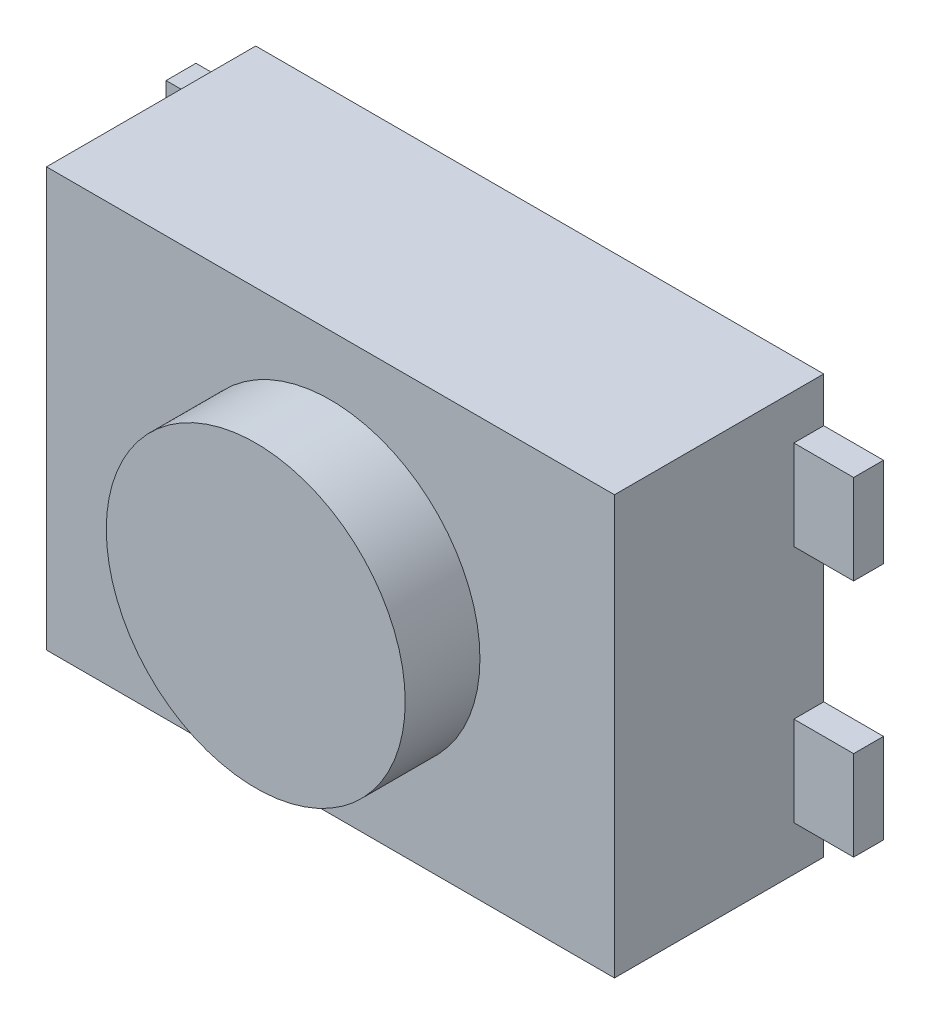
ISO-10303-21;
HEADER;
FILE_DESCRIPTION(('STEP AP214'),'2;1');
FILE_NAME('part.step','',(''),(''),'','','');
FILE_SCHEMA(('AUTOMOTIVE_DESIGN { 1 0 10303 214 1 1 1 1 }'));
ENDSEC;
DATA;
#1=APPLICATION_CONTEXT('core data for automotive mechanical design processes');
#2=APPLICATION_PROTOCOL_DEFINITION('international standard','automotive_design',2000,#1);
#3=PRODUCT_CONTEXT('',#1,'mechanical');
#4=PRODUCT('Part','Part','',(#3));
#5=PRODUCT_RELATED_PRODUCT_CATEGORY('part','',(#4));
#6=PRODUCT_DEFINITION_FORMATION('','',#4);
#7=PRODUCT_DEFINITION_CONTEXT('part definition',#1,'design');
#8=PRODUCT_DEFINITION('design','',#6,#7);
#9=PRODUCT_DEFINITION_SHAPE('','',#8);
#10=(LENGTH_UNIT() NAMED_UNIT(*) SI_UNIT(.MILLI.,.METRE.));
#11=(NAMED_UNIT(*) PLANE_ANGLE_UNIT() SI_UNIT($,.RADIAN.));
#12=(NAMED_UNIT(*) SI_UNIT($,.STERADIAN.) SOLID_ANGLE_UNIT());
#13=UNCERTAINTY_MEASURE_WITH_UNIT(LENGTH_MEASURE(1.E-05),#10,'distance_accuracy_value','');
#14=(GEOMETRIC_REPRESENTATION_CONTEXT(3) GLOBAL_UNCERTAINTY_ASSIGNED_CONTEXT((#13)) GLOBAL_UNIT_ASSIGNED_CONTEXT((#10,
#11,#12)) REPRESENTATION_CONTEXT('',''));
#15=CARTESIAN_POINT('',(0.,0.,0.));
#16=DIRECTION('',(0.,0.,1.));
#17=DIRECTION('',(1.,0.,0.));
#18=AXIS2_PLACEMENT_3D('',#15,#16,#17);
#19=CARTESIAN_POINT('',(2.1,0.8,0.));
#20=DIRECTION('',(0.,0.,1.));
#21=DIRECTION('',(1.,0.,0.));
#22=AXIS2_PLACEMENT_3D('',#19,#20,#21);
#23=PLANE('',#22);
#24=DIRECTION('',(-1.,0.,0.));
#25=VECTOR('',#24,1.);
#26=CARTESIAN_POINT('',(2.3,1.1,0.));
#27=LINE('',#26,#25);
#28=CARTESIAN_POINT('',(2.3,1.1,0.));
#29=VERTEX_POINT('',#28);
#30=CARTESIAN_POINT('',(1.9,1.1,0.));
#31=VERTEX_POINT('',#30);
#32=EDGE_CURVE('P0_E79',#29,#31,#27,.T.);
#33=ORIENTED_EDGE('',*,*,#32,.F.);
#34=DIRECTION('',(0.,1.,0.));
#35=VECTOR('',#34,1.);
#36=CARTESIAN_POINT('',(2.3,0.5,0.));
#37=LINE('',#36,#35);
#38=CARTESIAN_POINT('',(2.3,0.5,0.));
#39=VERTEX_POINT('',#38);
#40=EDGE_CURVE('P0_E55',#39,#29,#37,.T.);
#41=ORIENTED_EDGE('',*,*,#40,.F.);
#42=DIRECTION('',(1.,0.,0.));
#43=VECTOR('',#42,1.);
#44=CARTESIAN_POINT('',(1.9,0.5,0.));
#45=LINE('',#44,#43);
#46=CARTESIAN_POINT('',(1.9,0.5,0.));
#47=VERTEX_POINT('',#46);
#48=EDGE_CURVE('P0_E57',#47,#39,#45,.T.);
#49=ORIENTED_EDGE('',*,*,#48,.F.);
#50=DIRECTION('',(0.,1.,0.));
#51=VECTOR('',#50,1.);
#52=CARTESIAN_POINT('',(1.9,1.1,0.));
#53=LINE('',#52,#51);
#54=EDGE_CURVE('P0_E20',#31,#47,#53,.F.);
#55=ORIENTED_EDGE('',*,*,#54,.F.);
#56=EDGE_LOOP('',(#33,#41,#49,#55));
#57=FACE_BOUND('',#56,.T.);
#58=ADVANCED_FACE('P0_F17',(#57),#23,.F.);
#59=CARTESIAN_POINT('',(1.9,1.1,0.));
#60=DIRECTION('',(-1.,0.,0.));
#61=DIRECTION('',(0.,0.,1.));
#62=AXIS2_PLACEMENT_3D('',#59,#60,#61);
#63=PLANE('',#62);
#64=DIRECTION('',(0.,1.,0.));
#65=VECTOR('',#64,1.);
#66=CARTESIAN_POINT('',(1.9,0.8,0.2));
#67=LINE('',#66,#65);
#68=CARTESIAN_POINT('',(1.9,1.1,0.2));
#69=VERTEX_POINT('',#68);
#70=CARTESIAN_POINT('',(1.9,0.5,0.2));
#71=VERTEX_POINT('',#70);
#72=EDGE_CURVE('P0_E83',#69,#71,#67,.F.);
#73=ORIENTED_EDGE('',*,*,#72,.F.);
#74=DIRECTION('',(0.,0.,1.));
#75=VECTOR('',#74,1.);
#76=CARTESIAN_POINT('',(1.9,1.1,0.));
#77=LINE('',#76,#75);
#78=EDGE_CURVE('P0_E68',#31,#69,#77,.T.);
#79=ORIENTED_EDGE('',*,*,#78,.F.);
#80=ORIENTED_EDGE('',*,*,#54,.T.);
#81=DIRECTION('',(0.,0.,-1.));
#82=VECTOR('',#81,1.);
#83=CARTESIAN_POINT('',(1.9,0.5,0.));
#84=LINE('',#83,#82);
#85=EDGE_CURVE('P0_E63',#71,#47,#84,.T.);
#86=ORIENTED_EDGE('',*,*,#85,.F.);
#87=EDGE_LOOP('',(#73,#79,#80,#86));
#88=FACE_BOUND('',#87,.T.);
#89=ADVANCED_FACE('P0_F65',(#88),#63,.T.);
#90=CARTESIAN_POINT('',(1.9,0.5,0.));
#91=DIRECTION('',(0.,-1.,0.));
#92=DIRECTION('',(0.,0.,-1.));
#93=AXIS2_PLACEMENT_3D('',#90,#91,#92);
#94=PLANE('',#93);
#95=DIRECTION('',(1.,0.,0.));
#96=VECTOR('',#95,1.);
#97=CARTESIAN_POINT('',(2.1,0.5,0.2));
#98=LINE('',#97,#96);
#99=CARTESIAN_POINT('',(2.3,0.5,0.2));
#100=VERTEX_POINT('',#99);
#101=EDGE_CURVE('P0_E72',#71,#100,#98,.T.);
#102=ORIENTED_EDGE('',*,*,#101,.F.);
#103=ORIENTED_EDGE('',*,*,#85,.T.);
#104=ORIENTED_EDGE('',*,*,#48,.T.);
#105=DIRECTION('',(0.,0.,-1.));
#106=VECTOR('',#105,1.);
#107=CARTESIAN_POINT('',(2.3,0.5,0.));
#108=LINE('',#107,#106);
#109=EDGE_CURVE('P0_E75',#100,#39,#108,.T.);
#110=ORIENTED_EDGE('',*,*,#109,.F.);
#111=EDGE_LOOP('',(#102,#103,#104,#110));
#112=FACE_BOUND('',#111,.T.);
#113=ADVANCED_FACE('P0_F70',(#112),#94,.T.);
#114=CARTESIAN_POINT('',(2.3,0.5,0.));
#115=DIRECTION('',(1.,0.,0.));
#116=DIRECTION('',(0.,0.,-1.));
#117=AXIS2_PLACEMENT_3D('',#114,#115,#116);
#118=PLANE('',#117);
#119=DIRECTION('',(0.,1.,0.));
#120=VECTOR('',#119,1.);
#121=CARTESIAN_POINT('',(2.3,0.8,0.2));
#122=LINE('',#121,#120);
#123=CARTESIAN_POINT('',(2.3,1.1,0.2));
#124=VERTEX_POINT('',#123);
#125=EDGE_CURVE('P0_E26',#100,#124,#122,.T.);
#126=ORIENTED_EDGE('',*,*,#125,.F.);
#127=ORIENTED_EDGE('',*,*,#109,.T.);
#128=ORIENTED_EDGE('',*,*,#40,.T.);
#129=DIRECTION('',(0.,0.,1.));
#130=VECTOR('',#129,1.);
#131=CARTESIAN_POINT('',(2.3,1.1,0.));
#132=LINE('',#131,#130);
#133=EDGE_CURVE('P0_E35',#124,#29,#132,.F.);
#134=ORIENTED_EDGE('',*,*,#133,.F.);
#135=EDGE_LOOP('',(#126,#127,#128,#134));
#136=FACE_BOUND('',#135,.T.);
#137=ADVANCED_FACE('P0_F89',(#136),#118,.T.);
#138=CARTESIAN_POINT('',(2.3,1.1,0.));
#139=DIRECTION('',(0.,1.,0.));
#140=DIRECTION('',(-1.,0.,0.));
#141=AXIS2_PLACEMENT_3D('',#138,#139,#140);
#142=PLANE('',#141);
#143=DIRECTION('',(1.,0.,0.));
#144=VECTOR('',#143,1.);
#145=CARTESIAN_POINT('',(2.1,1.1,0.2));
#146=LINE('',#145,#144);
#147=EDGE_CURVE('P0_E11',#124,#69,#146,.F.);
#148=ORIENTED_EDGE('',*,*,#147,.F.);
#149=ORIENTED_EDGE('',*,*,#133,.T.);
#150=ORIENTED_EDGE('',*,*,#32,.T.);
#151=ORIENTED_EDGE('',*,*,#78,.T.);
#152=EDGE_LOOP('',(#148,#149,#150,#151));
#153=FACE_BOUND('',#152,.T.);
#154=ADVANCED_FACE('P0_F91',(#153),#142,.T.);
#155=CARTESIAN_POINT('',(2.1,0.8,0.2));
#156=DIRECTION('',(0.,0.,1.));
#157=DIRECTION('',(1.,0.,0.));
#158=AXIS2_PLACEMENT_3D('',#155,#156,#157);
#159=PLANE('',#158);
#160=ORIENTED_EDGE('',*,*,#125,.T.);
#161=ORIENTED_EDGE('',*,*,#147,.T.);
#162=ORIENTED_EDGE('',*,*,#72,.T.);
#163=ORIENTED_EDGE('',*,*,#101,.T.);
#164=EDGE_LOOP('',(#160,#161,#162,#163));
#165=FACE_BOUND('',#164,.T.);
#166=ADVANCED_FACE('P0_F88',(#165),#159,.T.);
#167=CLOSED_SHELL('',(#58,#89,#113,#137,#154,#166));
#168=MANIFOLD_SOLID_BREP('P0_B1',#167);
#169=CARTESIAN_POINT('',(-2.1,-0.8,0.));
#170=DIRECTION('',(0.,0.,1.));
#171=DIRECTION('',(1.,0.,0.));
#172=AXIS2_PLACEMENT_3D('',#169,#170,#171);
#173=PLANE('',#172);
#174=DIRECTION('',(1.,0.,0.));
#175=VECTOR('',#174,1.);
#176=CARTESIAN_POINT('',(-2.3,-1.1,0.));
#177=LINE('',#176,#175);
#178=CARTESIAN_POINT('',(-2.3,-1.1,0.));
#179=VERTEX_POINT('',#178);
#180=CARTESIAN_POINT('',(-1.9,-1.1,0.));
#181=VERTEX_POINT('',#180);
#182=EDGE_CURVE('P1_E79',#179,#181,#177,.T.);
#183=ORIENTED_EDGE('',*,*,#182,.F.);
#184=DIRECTION('',(0.,-1.,0.));
#185=VECTOR('',#184,1.);
#186=CARTESIAN_POINT('',(-2.3,-0.500000000000001,0.));
#187=LINE('',#186,#185);
#188=CARTESIAN_POINT('',(-2.3,-0.500000000000001,0.));
#189=VERTEX_POINT('',#188);
#190=EDGE_CURVE('P1_E55',#189,#179,#187,.T.);
#191=ORIENTED_EDGE('',*,*,#190,.F.);
#192=DIRECTION('',(-1.,0.,0.));
#193=VECTOR('',#192,1.);
#194=CARTESIAN_POINT('',(-1.9,-0.500000000000001,0.));
#195=LINE('',#194,#193);
#196=CARTESIAN_POINT('',(-1.9,-0.500000000000001,0.));
#197=VERTEX_POINT('',#196);
#198=EDGE_CURVE('P1_E57',#197,#189,#195,.T.);
#199=ORIENTED_EDGE('',*,*,#198,.F.);
#200=DIRECTION('',(0.,1.,0.));
#201=VECTOR('',#200,1.);
#202=CARTESIAN_POINT('',(-1.9,-1.1,0.));
#203=LINE('',#202,#201);
#204=EDGE_CURVE('P1_E20',#181,#197,#203,.T.);
#205=ORIENTED_EDGE('',*,*,#204,.F.);
#206=EDGE_LOOP('',(#183,#191,#199,#205));
#207=FACE_BOUND('',#206,.T.);
#208=ADVANCED_FACE('P1_F17',(#207),#173,.F.);
#209=CARTESIAN_POINT('',(-1.9,-1.1,0.));
#210=DIRECTION('',(1.,0.,0.));
#211=DIRECTION('',(0.,0.,-1.));
#212=AXIS2_PLACEMENT_3D('',#209,#210,#211);
#213=PLANE('',#212);
#214=DIRECTION('',(0.,1.,0.));
#215=VECTOR('',#214,1.);
#216=CARTESIAN_POINT('',(-1.9,-0.8,0.2));
#217=LINE('',#216,#215);
#218=CARTESIAN_POINT('',(-1.9,-1.1,0.2));
#219=VERTEX_POINT('',#218);
#220=CARTESIAN_POINT('',(-1.9,-0.500000000000001,0.2));
#221=VERTEX_POINT('',#220);
#222=EDGE_CURVE('P1_E83',#219,#221,#217,.T.);
#223=ORIENTED_EDGE('',*,*,#222,.F.);
#224=DIRECTION('',(0.,0.,-1.));
#225=VECTOR('',#224,1.);
#226=CARTESIAN_POINT('',(-1.9,-1.1,0.));
#227=LINE('',#226,#225);
#228=EDGE_CURVE('P1_E68',#181,#219,#227,.F.);
#229=ORIENTED_EDGE('',*,*,#228,.F.);
#230=ORIENTED_EDGE('',*,*,#204,.T.);
#231=DIRECTION('',(0.,0.,1.));
#232=VECTOR('',#231,1.);
#233=CARTESIAN_POINT('',(-1.9,-0.500000000000001,0.));
#234=LINE('',#233,#232);
#235=EDGE_CURVE('P1_E63',#221,#197,#234,.F.);
#236=ORIENTED_EDGE('',*,*,#235,.F.);
#237=EDGE_LOOP('',(#223,#229,#230,#236));
#238=FACE_BOUND('',#237,.T.);
#239=ADVANCED_FACE('P1_F65',(#238),#213,.T.);
#240=CARTESIAN_POINT('',(-1.9,-0.500000000000001,0.));
#241=DIRECTION('',(0.,1.,0.));
#242=DIRECTION('',(-1.,0.,0.));
#243=AXIS2_PLACEMENT_3D('',#240,#241,#242);
#244=PLANE('',#243);
#245=DIRECTION('',(1.,0.,0.));
#246=VECTOR('',#245,1.);
#247=CARTESIAN_POINT('',(-2.1,-0.500000000000001,0.2));
#248=LINE('',#247,#246);
#249=CARTESIAN_POINT('',(-2.3,-0.500000000000001,0.2));
#250=VERTEX_POINT('',#249);
#251=EDGE_CURVE('P1_E72',#221,#250,#248,.F.);
#252=ORIENTED_EDGE('',*,*,#251,.F.);
#253=ORIENTED_EDGE('',*,*,#235,.T.);
#254=ORIENTED_EDGE('',*,*,#198,.T.);
#255=DIRECTION('',(0.,0.,1.));
#256=VECTOR('',#255,1.);
#257=CARTESIAN_POINT('',(-2.3,-0.500000000000001,0.));
#258=LINE('',#257,#256);
#259=EDGE_CURVE('P1_E75',#250,#189,#258,.F.);
#260=ORIENTED_EDGE('',*,*,#259,.F.);
#261=EDGE_LOOP('',(#252,#253,#254,#260));
#262=FACE_BOUND('',#261,.T.);
#263=ADVANCED_FACE('P1_F70',(#262),#244,.T.);
#264=CARTESIAN_POINT('',(-2.3,-0.500000000000001,0.));
#265=DIRECTION('',(-1.,0.,0.));
#266=DIRECTION('',(0.,-1.,0.));
#267=AXIS2_PLACEMENT_3D('',#264,#265,#266);
#268=PLANE('',#267);
#269=DIRECTION('',(0.,1.,0.));
#270=VECTOR('',#269,1.);
#271=CARTESIAN_POINT('',(-2.3,-0.8,0.2));
#272=LINE('',#271,#270);
#273=CARTESIAN_POINT('',(-2.3,-1.1,0.2));
#274=VERTEX_POINT('',#273);
#275=EDGE_CURVE('P1_E26',#250,#274,#272,.F.);
#276=ORIENTED_EDGE('',*,*,#275,.F.);
#277=ORIENTED_EDGE('',*,*,#259,.T.);
#278=ORIENTED_EDGE('',*,*,#190,.T.);
#279=DIRECTION('',(0.,0.,-1.));
#280=VECTOR('',#279,1.);
#281=CARTESIAN_POINT('',(-2.3,-1.1,0.));
#282=LINE('',#281,#280);
#283=EDGE_CURVE('P1_E35',#274,#179,#282,.T.);
#284=ORIENTED_EDGE('',*,*,#283,.F.);
#285=EDGE_LOOP('',(#276,#277,#278,#284));
#286=FACE_BOUND('',#285,.T.);
#287=ADVANCED_FACE('P1_F89',(#286),#268,.T.);
#288=CARTESIAN_POINT('',(-2.3,-1.1,0.));
#289=DIRECTION('',(0.,-1.,0.));
#290=DIRECTION('',(0.,0.,-1.));
#291=AXIS2_PLACEMENT_3D('',#288,#289,#290);
#292=PLANE('',#291);
#293=DIRECTION('',(1.,0.,0.));
#294=VECTOR('',#293,1.);
#295=CARTESIAN_POINT('',(-2.1,-1.1,0.2));
#296=LINE('',#295,#294);
#297=EDGE_CURVE('P1_E11',#274,#219,#296,.T.);
#298=ORIENTED_EDGE('',*,*,#297,.F.);
#299=ORIENTED_EDGE('',*,*,#283,.T.);
#300=ORIENTED_EDGE('',*,*,#182,.T.);
#301=ORIENTED_EDGE('',*,*,#228,.T.);
#302=EDGE_LOOP('',(#298,#299,#300,#301));
#303=FACE_BOUND('',#302,.T.);
#304=ADVANCED_FACE('P1_F91',(#303),#292,.T.);
#305=CARTESIAN_POINT('',(-2.1,-0.8,0.2));
#306=DIRECTION('',(0.,0.,1.));
#307=DIRECTION('',(1.,0.,0.));
#308=AXIS2_PLACEMENT_3D('',#305,#306,#307);
#309=PLANE('',#308);
#310=ORIENTED_EDGE('',*,*,#275,.T.);
#311=ORIENTED_EDGE('',*,*,#297,.T.);
#312=ORIENTED_EDGE('',*,*,#222,.T.);
#313=ORIENTED_EDGE('',*,*,#251,.T.);
#314=EDGE_LOOP('',(#310,#311,#312,#313));
#315=FACE_BOUND('',#314,.T.);
#316=ADVANCED_FACE('P1_F88',(#315),#309,.T.);
#317=CLOSED_SHELL('',(#208,#239,#263,#287,#304,#316));
#318=MANIFOLD_SOLID_BREP('P1_B1',#317);
#319=CARTESIAN_POINT('',(0.,0.,1.9));
#320=DIRECTION('',(0.,0.,1.));
#321=DIRECTION('',(1.,0.,0.));
#322=AXIS2_PLACEMENT_3D('',#319,#320,#321);
#323=PLANE('',#322);
#324=CARTESIAN_POINT('',(0.,0.,1.9));
#325=DIRECTION('',(0.,0.,1.));
#326=DIRECTION('',(1.,0.,0.));
#327=AXIS2_PLACEMENT_3D('',#324,#325,#326);
#328=CIRCLE('',#327,1.);
#329=CARTESIAN_POINT('',(1.,0.,1.9));
#330=VERTEX_POINT('',#329);
#331=EDGE_CURVE('P2_E18',#330,#330,#328,.F.);
#332=ORIENTED_EDGE('',*,*,#331,.F.);
#333=EDGE_LOOP('',(#332));
#334=FACE_BOUND('',#333,.T.);
#335=ADVANCED_FACE('P2_F15',(#334),#323,.T.);
#336=CARTESIAN_POINT('',(0.,0.,1.4));
#337=DIRECTION('',(0.,0.,1.));
#338=DIRECTION('',(1.,0.,0.));
#339=AXIS2_PLACEMENT_3D('',#336,#337,#338);
#340=PLANE('',#339);
#341=CARTESIAN_POINT('',(0.,0.,1.4));
#342=DIRECTION('',(0.,0.,1.));
#343=DIRECTION('',(1.,0.,0.));
#344=AXIS2_PLACEMENT_3D('',#341,#342,#343);
#345=CIRCLE('',#344,1.);
#346=CARTESIAN_POINT('',(1.,0.,1.4));
#347=VERTEX_POINT('',#346);
#348=EDGE_CURVE('P2_E10',#347,#347,#345,.T.);
#349=ORIENTED_EDGE('',*,*,#348,.F.);
#350=EDGE_LOOP('',(#349));
#351=FACE_BOUND('',#350,.T.);
#352=ADVANCED_FACE('P2_F30',(#351),#340,.F.);
#353=CARTESIAN_POINT('',(0.,0.,1.4));
#354=DIRECTION('',(0.,0.,1.));
#355=DIRECTION('',(1.,0.,0.));
#356=AXIS2_PLACEMENT_3D('',#353,#354,#355);
#357=CYLINDRICAL_SURFACE('',#356,1.);
#358=ORIENTED_EDGE('',*,*,#348,.T.);
#359=EDGE_LOOP('',(#358));
#360=FACE_BOUND('',#359,.T.);
#361=ORIENTED_EDGE('',*,*,#331,.T.);
#362=EDGE_LOOP('',(#361));
#363=FACE_BOUND('',#362,.T.);
#364=ADVANCED_FACE('P2_F27',(#360,#363),#357,.T.);
#365=CLOSED_SHELL('',(#335,#352,#364));
#366=MANIFOLD_SOLID_BREP('P2_B1',#365);
#367=CARTESIAN_POINT('',(2.1,-0.8,0.));
#368=DIRECTION('',(0.,0.,1.));
#369=DIRECTION('',(1.,0.,0.));
#370=AXIS2_PLACEMENT_3D('',#367,#368,#369);
#371=PLANE('',#370);
#372=DIRECTION('',(0.,1.,0.));
#373=VECTOR('',#372,1.);
#374=CARTESIAN_POINT('',(2.3,-1.1,0.));
#375=LINE('',#374,#373);
#376=CARTESIAN_POINT('',(2.3,-1.1,0.));
#377=VERTEX_POINT('',#376);
#378=CARTESIAN_POINT('',(2.3,-0.5,0.));
#379=VERTEX_POINT('',#378);
#380=EDGE_CURVE('P3_E79',#377,#379,#375,.T.);
#381=ORIENTED_EDGE('',*,*,#380,.F.);
#382=DIRECTION('',(1.,0.,0.));
#383=VECTOR('',#382,1.);
#384=CARTESIAN_POINT('',(1.9,-1.1,0.));
#385=LINE('',#384,#383);
#386=CARTESIAN_POINT('',(1.9,-1.1,0.));
#387=VERTEX_POINT('',#386);
#388=EDGE_CURVE('P3_E55',#387,#377,#385,.T.);
#389=ORIENTED_EDGE('',*,*,#388,.F.);
#390=DIRECTION('',(0.,1.,0.));
#391=VECTOR('',#390,1.);
#392=CARTESIAN_POINT('',(1.9,-0.5,0.));
#393=LINE('',#392,#391);
#394=CARTESIAN_POINT('',(1.9,-0.5,0.));
#395=VERTEX_POINT('',#394);
#396=EDGE_CURVE('P3_E57',#395,#387,#393,.F.);
#397=ORIENTED_EDGE('',*,*,#396,.F.);
#398=DIRECTION('',(1.,0.,0.));
#399=VECTOR('',#398,1.);
#400=CARTESIAN_POINT('',(2.3,-0.5,0.));
#401=LINE('',#400,#399);
#402=EDGE_CURVE('P3_E20',#379,#395,#401,.F.);
#403=ORIENTED_EDGE('',*,*,#402,.F.);
#404=EDGE_LOOP('',(#381,#389,#397,#403));
#405=FACE_BOUND('',#404,.T.);
#406=ADVANCED_FACE('P3_F17',(#405),#371,.F.);
#407=CARTESIAN_POINT('',(2.3,-0.5,0.));
#408=DIRECTION('',(0.,1.,0.));
#409=DIRECTION('',(0.,0.,1.));
#410=AXIS2_PLACEMENT_3D('',#407,#408,#409);
#411=PLANE('',#410);
#412=DIRECTION('',(1.,0.,0.));
#413=VECTOR('',#412,1.);
#414=CARTESIAN_POINT('',(2.1,-0.5,0.2));
#415=LINE('',#414,#413);
#416=CARTESIAN_POINT('',(2.3,-0.5,0.2));
#417=VERTEX_POINT('',#416);
#418=CARTESIAN_POINT('',(1.9,-0.5,0.2));
#419=VERTEX_POINT('',#418);
#420=EDGE_CURVE('P3_E83',#417,#419,#415,.F.);
#421=ORIENTED_EDGE('',*,*,#420,.F.);
#422=DIRECTION('',(0.,0.,1.));
#423=VECTOR('',#422,1.);
#424=CARTESIAN_POINT('',(2.3,-0.5,0.));
#425=LINE('',#424,#423);
#426=EDGE_CURVE('P3_E68',#379,#417,#425,.T.);
#427=ORIENTED_EDGE('',*,*,#426,.F.);
#428=ORIENTED_EDGE('',*,*,#402,.T.);
#429=DIRECTION('',(0.,0.,1.));
#430=VECTOR('',#429,1.);
#431=CARTESIAN_POINT('',(1.9,-0.5,0.));
#432=LINE('',#431,#430);
#433=EDGE_CURVE('P3_E63',#419,#395,#432,.F.);
#434=ORIENTED_EDGE('',*,*,#433,.F.);
#435=EDGE_LOOP('',(#421,#427,#428,#434));
#436=FACE_BOUND('',#435,.T.);
#437=ADVANCED_FACE('P3_F65',(#436),#411,.T.);
#438=CARTESIAN_POINT('',(1.9,-0.5,0.));
#439=DIRECTION('',(-1.,0.,0.));
#440=DIRECTION('',(0.,0.,1.));
#441=AXIS2_PLACEMENT_3D('',#438,#439,#440);
#442=PLANE('',#441);
#443=DIRECTION('',(0.,1.,0.));
#444=VECTOR('',#443,1.);
#445=CARTESIAN_POINT('',(1.9,-0.8,0.2));
#446=LINE('',#445,#444);
#447=CARTESIAN_POINT('',(1.9,-1.1,0.2));
#448=VERTEX_POINT('',#447);
#449=EDGE_CURVE('P3_E72',#419,#448,#446,.F.);
#450=ORIENTED_EDGE('',*,*,#449,.F.);
#451=ORIENTED_EDGE('',*,*,#433,.T.);
#452=ORIENTED_EDGE('',*,*,#396,.T.);
#453=DIRECTION('',(0.,0.,1.));
#454=VECTOR('',#453,1.);
#455=CARTESIAN_POINT('',(1.9,-1.1,0.));
#456=LINE('',#455,#454);
#457=EDGE_CURVE('P3_E75',#448,#387,#456,.F.);
#458=ORIENTED_EDGE('',*,*,#457,.F.);
#459=EDGE_LOOP('',(#450,#451,#452,#458));
#460=FACE_BOUND('',#459,.T.);
#461=ADVANCED_FACE('P3_F70',(#460),#442,.T.);
#462=CARTESIAN_POINT('',(1.9,-1.1,0.));
#463=DIRECTION('',(0.,-1.,0.));
#464=DIRECTION('',(1.,0.,0.));
#465=AXIS2_PLACEMENT_3D('',#462,#463,#464);
#466=PLANE('',#465);
#467=DIRECTION('',(1.,0.,0.));
#468=VECTOR('',#467,1.);
#469=CARTESIAN_POINT('',(2.1,-1.1,0.2));
#470=LINE('',#469,#468);
#471=CARTESIAN_POINT('',(2.3,-1.1,0.2));
#472=VERTEX_POINT('',#471);
#473=EDGE_CURVE('P3_E26',#448,#472,#470,.T.);
#474=ORIENTED_EDGE('',*,*,#473,.F.);
#475=ORIENTED_EDGE('',*,*,#457,.T.);
#476=ORIENTED_EDGE('',*,*,#388,.T.);
#477=DIRECTION('',(0.,0.,1.));
#478=VECTOR('',#477,1.);
#479=CARTESIAN_POINT('',(2.3,-1.1,0.));
#480=LINE('',#479,#478);
#481=EDGE_CURVE('P3_E35',#472,#377,#480,.F.);
#482=ORIENTED_EDGE('',*,*,#481,.F.);
#483=EDGE_LOOP('',(#474,#475,#476,#482));
#484=FACE_BOUND('',#483,.T.);
#485=ADVANCED_FACE('P3_F89',(#484),#466,.T.);
#486=CARTESIAN_POINT('',(2.3,-1.1,0.));
#487=DIRECTION('',(1.,0.,0.));
#488=DIRECTION('',(0.,1.,0.));
#489=AXIS2_PLACEMENT_3D('',#486,#487,#488);
#490=PLANE('',#489);
#491=DIRECTION('',(0.,1.,0.));
#492=VECTOR('',#491,1.);
#493=CARTESIAN_POINT('',(2.3,-0.8,0.2));
#494=LINE('',#493,#492);
#495=EDGE_CURVE('P3_E11',#472,#417,#494,.T.);
#496=ORIENTED_EDGE('',*,*,#495,.F.);
#497=ORIENTED_EDGE('',*,*,#481,.T.);
#498=ORIENTED_EDGE('',*,*,#380,.T.);
#499=ORIENTED_EDGE('',*,*,#426,.T.);
#500=EDGE_LOOP('',(#496,#497,#498,#499));
#501=FACE_BOUND('',#500,.T.);
#502=ADVANCED_FACE('P3_F91',(#501),#490,.T.);
#503=CARTESIAN_POINT('',(2.1,-0.8,0.2));
#504=DIRECTION('',(0.,0.,1.));
#505=DIRECTION('',(1.,0.,0.));
#506=AXIS2_PLACEMENT_3D('',#503,#504,#505);
#507=PLANE('',#506);
#508=ORIENTED_EDGE('',*,*,#473,.T.);
#509=ORIENTED_EDGE('',*,*,#495,.T.);
#510=ORIENTED_EDGE('',*,*,#420,.T.);
#511=ORIENTED_EDGE('',*,*,#449,.T.);
#512=EDGE_LOOP('',(#508,#509,#510,#511));
#513=FACE_BOUND('',#512,.T.);
#514=ADVANCED_FACE('P3_F88',(#513),#507,.T.);
#515=CLOSED_SHELL('',(#406,#437,#461,#485,#502,#514));
#516=MANIFOLD_SOLID_BREP('P3_B1',#515);
#517=CARTESIAN_POINT('',(0.,0.,0.));
#518=DIRECTION('',(0.,0.,1.));
#519=DIRECTION('',(1.,0.,0.));
#520=AXIS2_PLACEMENT_3D('',#517,#518,#519);
#521=PLANE('',#520);
#522=DIRECTION('',(0.,1.,0.));
#523=VECTOR('',#522,1.);
#524=CARTESIAN_POINT('',(-1.9,1.4,0.));
#525=LINE('',#524,#523);
#526=CARTESIAN_POINT('',(-1.9,1.4,0.));
#527=VERTEX_POINT('',#526);
#528=CARTESIAN_POINT('',(-1.9,-1.4,0.));
#529=VERTEX_POINT('',#528);
#530=EDGE_CURVE('P4_E79',#527,#529,#525,.F.);
#531=ORIENTED_EDGE('',*,*,#530,.F.);
#532=DIRECTION('',(1.,0.,0.));
#533=VECTOR('',#532,1.);
#534=CARTESIAN_POINT('',(1.9,1.4,0.));
#535=LINE('',#534,#533);
#536=CARTESIAN_POINT('',(1.9,1.4,0.));
#537=VERTEX_POINT('',#536);
#538=EDGE_CURVE('P4_E55',#537,#527,#535,.F.);
#539=ORIENTED_EDGE('',*,*,#538,.F.);
#540=DIRECTION('',(0.,1.,0.));
#541=VECTOR('',#540,1.);
#542=CARTESIAN_POINT('',(1.9,-1.4,0.));
#543=LINE('',#542,#541);
#544=CARTESIAN_POINT('',(1.9,-1.4,0.));
#545=VERTEX_POINT('',#544);
#546=EDGE_CURVE('P4_E57',#545,#537,#543,.T.);
#547=ORIENTED_EDGE('',*,*,#546,.F.);
#548=DIRECTION('',(1.,0.,0.));
#549=VECTOR('',#548,1.);
#550=CARTESIAN_POINT('',(-1.9,-1.4,0.));
#551=LINE('',#550,#549);
#552=EDGE_CURVE('P4_E20',#529,#545,#551,.T.);
#553=ORIENTED_EDGE('',*,*,#552,.F.);
#554=EDGE_LOOP('',(#531,#539,#547,#553));
#555=FACE_BOUND('',#554,.T.);
#556=ADVANCED_FACE('P4_F17',(#555),#521,.F.);
#557=CARTESIAN_POINT('',(-1.9,-1.4,0.));
#558=DIRECTION('',(0.,-1.,0.));
#559=DIRECTION('',(0.,0.,-1.));
#560=AXIS2_PLACEMENT_3D('',#557,#558,#559);
#561=PLANE('',#560);
#562=DIRECTION('',(1.,0.,0.));
#563=VECTOR('',#562,1.);
#564=CARTESIAN_POINT('',(0.,-1.4,1.4));
#565=LINE('',#564,#563);
#566=CARTESIAN_POINT('',(-1.9,-1.4,1.4));
#567=VERTEX_POINT('',#566);
#568=CARTESIAN_POINT('',(1.9,-1.4,1.4));
#569=VERTEX_POINT('',#568);
#570=EDGE_CURVE('P4_E83',#567,#569,#565,.T.);
#571=ORIENTED_EDGE('',*,*,#570,.F.);
#572=DIRECTION('',(0.,0.,1.));
#573=VECTOR('',#572,1.);
#574=CARTESIAN_POINT('',(-1.9,-1.4,0.));
#575=LINE('',#574,#573);
#576=EDGE_CURVE('P4_E68',#529,#567,#575,.T.);
#577=ORIENTED_EDGE('',*,*,#576,.F.);
#578=ORIENTED_EDGE('',*,*,#552,.T.);
#579=DIRECTION('',(0.,0.,-1.));
#580=VECTOR('',#579,1.);
#581=CARTESIAN_POINT('',(1.9,-1.4,0.));
#582=LINE('',#581,#580);
#583=EDGE_CURVE('P4_E63',#569,#545,#582,.T.);
#584=ORIENTED_EDGE('',*,*,#583,.F.);
#585=EDGE_LOOP('',(#571,#577,#578,#584));
#586=FACE_BOUND('',#585,.T.);
#587=ADVANCED_FACE('P4_F65',(#586),#561,.T.);
#588=CARTESIAN_POINT('',(1.9,-1.4,0.));
#589=DIRECTION('',(1.,0.,0.));
#590=DIRECTION('',(0.,0.,-1.));
#591=AXIS2_PLACEMENT_3D('',#588,#589,#590);
#592=PLANE('',#591);
#593=DIRECTION('',(0.,1.,0.));
#594=VECTOR('',#593,1.);
#595=CARTESIAN_POINT('',(1.9,0.,1.4));
#596=LINE('',#595,#594);
#597=CARTESIAN_POINT('',(1.9,1.4,1.4));
#598=VERTEX_POINT('',#597);
#599=EDGE_CURVE('P4_E72',#569,#598,#596,.T.);
#600=ORIENTED_EDGE('',*,*,#599,.F.);
#601=ORIENTED_EDGE('',*,*,#583,.T.);
#602=ORIENTED_EDGE('',*,*,#546,.T.);
#603=DIRECTION('',(0.,0.,1.));
#604=VECTOR('',#603,1.);
#605=CARTESIAN_POINT('',(1.9,1.4,0.));
#606=LINE('',#605,#604);
#607=EDGE_CURVE('P4_E75',#598,#537,#606,.F.);
#608=ORIENTED_EDGE('',*,*,#607,.F.);
#609=EDGE_LOOP('',(#600,#601,#602,#608));
#610=FACE_BOUND('',#609,.T.);
#611=ADVANCED_FACE('P4_F70',(#610),#592,.T.);
#612=CARTESIAN_POINT('',(1.9,1.4,0.));
#613=DIRECTION('',(0.,1.,0.));
#614=DIRECTION('',(0.,0.,1.));
#615=AXIS2_PLACEMENT_3D('',#612,#613,#614);
#616=PLANE('',#615);
#617=DIRECTION('',(1.,0.,0.));
#618=VECTOR('',#617,1.);
#619=CARTESIAN_POINT('',(0.,1.4,1.4));
#620=LINE('',#619,#618);
#621=CARTESIAN_POINT('',(-1.9,1.4,1.4));
#622=VERTEX_POINT('',#621);
#623=EDGE_CURVE('P4_E26',#598,#622,#620,.F.);
#624=ORIENTED_EDGE('',*,*,#623,.F.);
#625=ORIENTED_EDGE('',*,*,#607,.T.);
#626=ORIENTED_EDGE('',*,*,#538,.T.);
#627=DIRECTION('',(0.,0.,1.));
#628=VECTOR('',#627,1.);
#629=CARTESIAN_POINT('',(-1.9,1.4,0.));
#630=LINE('',#629,#628);
#631=EDGE_CURVE('P4_E35',#622,#527,#630,.F.);
#632=ORIENTED_EDGE('',*,*,#631,.F.);
#633=EDGE_LOOP('',(#624,#625,#626,#632));
#634=FACE_BOUND('',#633,.T.);
#635=ADVANCED_FACE('P4_F89',(#634),#616,.T.);
#636=CARTESIAN_POINT('',(-1.9,1.4,0.));
#637=DIRECTION('',(-1.,0.,0.));
#638=DIRECTION('',(0.,0.,1.));
#639=AXIS2_PLACEMENT_3D('',#636,#637,#638);
#640=PLANE('',#639);
#641=DIRECTION('',(0.,1.,0.));
#642=VECTOR('',#641,1.);
#643=CARTESIAN_POINT('',(-1.9,0.,1.4));
#644=LINE('',#643,#642);
#645=EDGE_CURVE('P4_E11',#622,#567,#644,.F.);
#646=ORIENTED_EDGE('',*,*,#645,.F.);
#647=ORIENTED_EDGE('',*,*,#631,.T.);
#648=ORIENTED_EDGE('',*,*,#530,.T.);
#649=ORIENTED_EDGE('',*,*,#576,.T.);
#650=EDGE_LOOP('',(#646,#647,#648,#649));
#651=FACE_BOUND('',#650,.T.);
#652=ADVANCED_FACE('P4_F91',(#651),#640,.T.);
#653=CARTESIAN_POINT('',(0.,0.,1.4));
#654=DIRECTION('',(0.,0.,1.));
#655=DIRECTION('',(1.,0.,0.));
#656=AXIS2_PLACEMENT_3D('',#653,#654,#655);
#657=PLANE('',#656);
#658=ORIENTED_EDGE('',*,*,#623,.T.);
#659=ORIENTED_EDGE('',*,*,#645,.T.);
#660=ORIENTED_EDGE('',*,*,#570,.T.);
#661=ORIENTED_EDGE('',*,*,#599,.T.);
#662=EDGE_LOOP('',(#658,#659,#660,#661));
#663=FACE_BOUND('',#662,.T.);
#664=ADVANCED_FACE('P4_F88',(#663),#657,.T.);
#665=CLOSED_SHELL('',(#556,#587,#611,#635,#652,#664));
#666=MANIFOLD_SOLID_BREP('P4_B1',#665);
#667=CARTESIAN_POINT('',(-2.1,0.8,0.));
#668=DIRECTION('',(0.,0.,1.));
#669=DIRECTION('',(1.,0.,0.));
#670=AXIS2_PLACEMENT_3D('',#667,#668,#669);
#671=PLANE('',#670);
#672=DIRECTION('',(0.,1.,0.));
#673=VECTOR('',#672,1.);
#674=CARTESIAN_POINT('',(-2.3,1.1,0.));
#675=LINE('',#674,#673);
#676=CARTESIAN_POINT('',(-2.3,1.1,0.));
#677=VERTEX_POINT('',#676);
#678=CARTESIAN_POINT('',(-2.3,0.5,0.));
#679=VERTEX_POINT('',#678);
#680=EDGE_CURVE('P5_E79',#677,#679,#675,.F.);
#681=ORIENTED_EDGE('',*,*,#680,.F.);
#682=DIRECTION('',(1.,0.,0.));
#683=VECTOR('',#682,1.);
#684=CARTESIAN_POINT('',(-1.9,1.1,0.));
#685=LINE('',#684,#683);
#686=CARTESIAN_POINT('',(-1.9,1.1,0.));
#687=VERTEX_POINT('',#686);
#688=EDGE_CURVE('P5_E55',#687,#677,#685,.F.);
#689=ORIENTED_EDGE('',*,*,#688,.F.);
#690=DIRECTION('',(0.,1.,0.));
#691=VECTOR('',#690,1.);
#692=CARTESIAN_POINT('',(-1.9,0.5,0.));
#693=LINE('',#692,#691);
#694=CARTESIAN_POINT('',(-1.9,0.5,0.));
#695=VERTEX_POINT('',#694);
#696=EDGE_CURVE('P5_E57',#695,#687,#693,.T.);
#697=ORIENTED_EDGE('',*,*,#696,.F.);
#698=DIRECTION('',(1.,0.,0.));
#699=VECTOR('',#698,1.);
#700=CARTESIAN_POINT('',(-2.3,0.5,0.));
#701=LINE('',#700,#699);
#702=EDGE_CURVE('P5_E20',#679,#695,#701,.T.);
#703=ORIENTED_EDGE('',*,*,#702,.F.);
#704=EDGE_LOOP('',(#681,#689,#697,#703));
#705=FACE_BOUND('',#704,.T.);
#706=ADVANCED_FACE('P5_F17',(#705),#671,.F.);
#707=CARTESIAN_POINT('',(-2.3,0.5,0.));
#708=DIRECTION('',(0.,-1.,0.));
#709=DIRECTION('',(1.,0.,0.));
#710=AXIS2_PLACEMENT_3D('',#707,#708,#709);
#711=PLANE('',#710);
#712=DIRECTION('',(1.,0.,0.));
#713=VECTOR('',#712,1.);
#714=CARTESIAN_POINT('',(-2.1,0.5,0.2));
#715=LINE('',#714,#713);
#716=CARTESIAN_POINT('',(-2.3,0.5,0.2));
#717=VERTEX_POINT('',#716);
#718=CARTESIAN_POINT('',(-1.9,0.5,0.2));
#719=VERTEX_POINT('',#718);
#720=EDGE_CURVE('P5_E83',#717,#719,#715,.T.);
#721=ORIENTED_EDGE('',*,*,#720,.F.);
#722=DIRECTION('',(0.,0.,1.));
#723=VECTOR('',#722,1.);
#724=CARTESIAN_POINT('',(-2.3,0.5,0.));
#725=LINE('',#724,#723);
#726=EDGE_CURVE('P5_E68',#679,#717,#725,.T.);
#727=ORIENTED_EDGE('',*,*,#726,.F.);
#728=ORIENTED_EDGE('',*,*,#702,.T.);
#729=DIRECTION('',(0.,0.,-1.));
#730=VECTOR('',#729,1.);
#731=CARTESIAN_POINT('',(-1.9,0.5,0.));
#732=LINE('',#731,#730);
#733=EDGE_CURVE('P5_E63',#719,#695,#732,.T.);
#734=ORIENTED_EDGE('',*,*,#733,.F.);
#735=EDGE_LOOP('',(#721,#727,#728,#734));
#736=FACE_BOUND('',#735,.T.);
#737=ADVANCED_FACE('P5_F65',(#736),#711,.T.);
#738=CARTESIAN_POINT('',(-1.9,0.5,0.));
#739=DIRECTION('',(1.,0.,0.));
#740=DIRECTION('',(0.,0.,-1.));
#741=AXIS2_PLACEMENT_3D('',#738,#739,#740);
#742=PLANE('',#741);
#743=DIRECTION('',(0.,1.,0.));
#744=VECTOR('',#743,1.);
#745=CARTESIAN_POINT('',(-1.9,0.8,0.2));
#746=LINE('',#745,#744);
#747=CARTESIAN_POINT('',(-1.9,1.1,0.2));
#748=VERTEX_POINT('',#747);
#749=EDGE_CURVE('P5_E72',#719,#748,#746,.T.);
#750=ORIENTED_EDGE('',*,*,#749,.F.);
#751=ORIENTED_EDGE('',*,*,#733,.T.);
#752=ORIENTED_EDGE('',*,*,#696,.T.);
#753=DIRECTION('',(0.,0.,1.));
#754=VECTOR('',#753,1.);
#755=CARTESIAN_POINT('',(-1.9,1.1,0.));
#756=LINE('',#755,#754);
#757=EDGE_CURVE('P5_E75',#748,#687,#756,.F.);
#758=ORIENTED_EDGE('',*,*,#757,.F.);
#759=EDGE_LOOP('',(#750,#751,#752,#758));
#760=FACE_BOUND('',#759,.T.);
#761=ADVANCED_FACE('P5_F70',(#760),#742,.T.);
#762=CARTESIAN_POINT('',(-1.9,1.1,0.));
#763=DIRECTION('',(0.,1.,0.));
#764=DIRECTION('',(0.,0.,1.));
#765=AXIS2_PLACEMENT_3D('',#762,#763,#764);
#766=PLANE('',#765);
#767=DIRECTION('',(1.,0.,0.));
#768=VECTOR('',#767,1.);
#769=CARTESIAN_POINT('',(-2.1,1.1,0.2));
#770=LINE('',#769,#768);
#771=CARTESIAN_POINT('',(-2.3,1.1,0.2));
#772=VERTEX_POINT('',#771);
#773=EDGE_CURVE('P5_E26',#748,#772,#770,.F.);
#774=ORIENTED_EDGE('',*,*,#773,.F.);
#775=ORIENTED_EDGE('',*,*,#757,.T.);
#776=ORIENTED_EDGE('',*,*,#688,.T.);
#777=DIRECTION('',(0.,0.,1.));
#778=VECTOR('',#777,1.);
#779=CARTESIAN_POINT('',(-2.3,1.1,0.));
#780=LINE('',#779,#778);
#781=EDGE_CURVE('P5_E35',#772,#677,#780,.F.);
#782=ORIENTED_EDGE('',*,*,#781,.F.);
#783=EDGE_LOOP('',(#774,#775,#776,#782));
#784=FACE_BOUND('',#783,.T.);
#785=ADVANCED_FACE('P5_F89',(#784),#766,.T.);
#786=CARTESIAN_POINT('',(-2.3,1.1,0.));
#787=DIRECTION('',(-1.,0.,0.));
#788=DIRECTION('',(0.,0.,1.));
#789=AXIS2_PLACEMENT_3D('',#786,#787,#788);
#790=PLANE('',#789);
#791=DIRECTION('',(0.,1.,0.));
#792=VECTOR('',#791,1.);
#793=CARTESIAN_POINT('',(-2.3,0.8,0.2));
#794=LINE('',#793,#792);
#795=EDGE_CURVE('P5_E11',#772,#717,#794,.F.);
#796=ORIENTED_EDGE('',*,*,#795,.F.);
#797=ORIENTED_EDGE('',*,*,#781,.T.);
#798=ORIENTED_EDGE('',*,*,#680,.T.);
#799=ORIENTED_EDGE('',*,*,#726,.T.);
#800=EDGE_LOOP('',(#796,#797,#798,#799));
#801=FACE_BOUND('',#800,.T.);
#802=ADVANCED_FACE('P5_F91',(#801),#790,.T.);
#803=CARTESIAN_POINT('',(-2.1,0.8,0.2));
#804=DIRECTION('',(0.,0.,1.));
#805=DIRECTION('',(1.,0.,0.));
#806=AXIS2_PLACEMENT_3D('',#803,#804,#805);
#807=PLANE('',#806);
#808=ORIENTED_EDGE('',*,*,#773,.T.);
#809=ORIENTED_EDGE('',*,*,#795,.T.);
#810=ORIENTED_EDGE('',*,*,#720,.T.);
#811=ORIENTED_EDGE('',*,*,#749,.T.);
#812=EDGE_LOOP('',(#808,#809,#810,#811));
#813=FACE_BOUND('',#812,.T.);
#814=ADVANCED_FACE('P5_F88',(#813),#807,.T.);
#815=CLOSED_SHELL('',(#706,#737,#761,#785,#802,#814));
#816=MANIFOLD_SOLID_BREP('P5_B1',#815);
#817=ADVANCED_BREP_SHAPE_REPRESENTATION('',(#18,#168,#318,#366,#516,#666,#816),#14);
#818=SHAPE_DEFINITION_REPRESENTATION(#9,#817);
ENDSEC;
END-ISO-10303-21;
